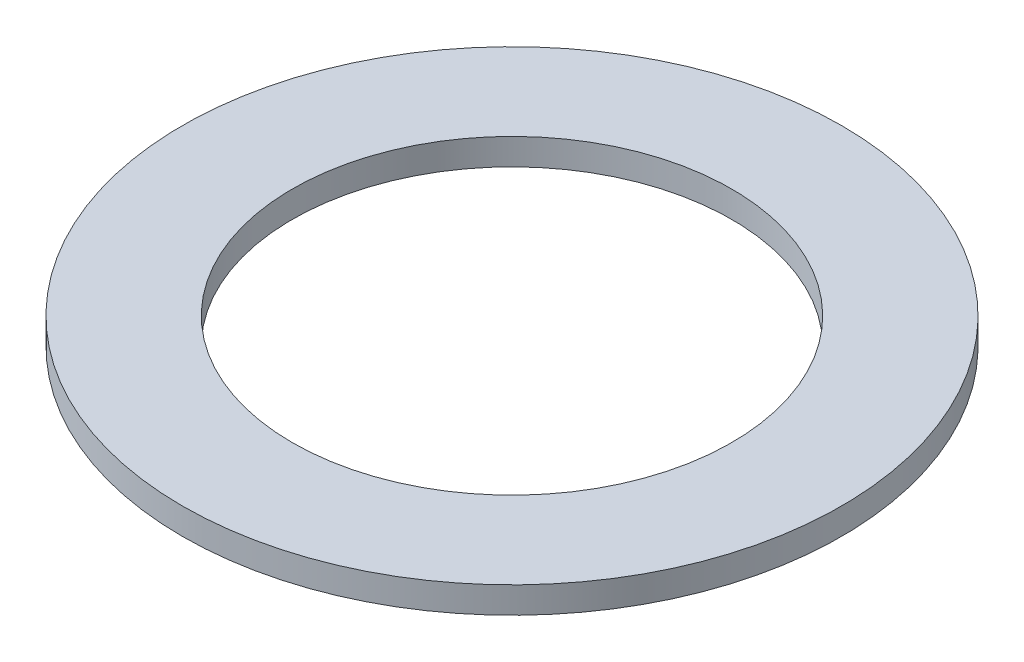
ISO-10303-21;
HEADER;
FILE_DESCRIPTION(('STEP AP214'),'2;1');
FILE_NAME('part.step','',(''),(''),'','','');
FILE_SCHEMA(('AUTOMOTIVE_DESIGN { 1 0 10303 214 1 1 1 1 }'));
ENDSEC;
DATA;
#1=APPLICATION_CONTEXT('core data for automotive mechanical design processes');
#2=APPLICATION_PROTOCOL_DEFINITION('international standard','automotive_design',2000,#1);
#3=PRODUCT_CONTEXT('',#1,'mechanical');
#4=PRODUCT('Part','Part','',(#3));
#5=PRODUCT_RELATED_PRODUCT_CATEGORY('part','',(#4));
#6=PRODUCT_DEFINITION_FORMATION('','',#4);
#7=PRODUCT_DEFINITION_CONTEXT('part definition',#1,'design');
#8=PRODUCT_DEFINITION('design','',#6,#7);
#9=PRODUCT_DEFINITION_SHAPE('','',#8);
#10=(LENGTH_UNIT() NAMED_UNIT(*) SI_UNIT(.MILLI.,.METRE.));
#11=(NAMED_UNIT(*) PLANE_ANGLE_UNIT() SI_UNIT($,.RADIAN.));
#12=(NAMED_UNIT(*) SI_UNIT($,.STERADIAN.) SOLID_ANGLE_UNIT());
#13=UNCERTAINTY_MEASURE_WITH_UNIT(LENGTH_MEASURE(1.E-05),#10,'distance_accuracy_value','');
#14=(GEOMETRIC_REPRESENTATION_CONTEXT(3) GLOBAL_UNCERTAINTY_ASSIGNED_CONTEXT((#13)) GLOBAL_UNIT_ASSIGNED_CONTEXT((#10,
#11,#12)) REPRESENTATION_CONTEXT('',''));
#15=CARTESIAN_POINT('',(0.,0.,0.));
#16=DIRECTION('',(0.,0.,1.));
#17=DIRECTION('',(1.,0.,0.));
#18=AXIS2_PLACEMENT_3D('',#15,#16,#17);
#19=CARTESIAN_POINT('',(0.,0.762,0.));
#20=DIRECTION('',(0.,-1.,0.));
#21=DIRECTION('',(0.,0.,-1.));
#22=AXIS2_PLACEMENT_3D('',#19,#20,#21);
#23=CYLINDRICAL_SURFACE('',#22,9.525);
#24=CARTESIAN_POINT('',(0.,0.762,0.));
#25=DIRECTION('',(0.,1.,0.));
#26=DIRECTION('',(0.,0.,1.));
#27=AXIS2_PLACEMENT_3D('',#24,#25,#26);
#28=CIRCLE('',#27,9.525);
#29=CARTESIAN_POINT('',(0.,0.762,9.525));
#30=VERTEX_POINT('',#29);
#31=EDGE_CURVE('E10',#30,#30,#28,.T.);
#32=ORIENTED_EDGE('',*,*,#31,.F.);
#33=EDGE_LOOP('',(#32));
#34=FACE_BOUND('',#33,.T.);
#35=CARTESIAN_POINT('',(0.,0.,0.));
#36=DIRECTION('',(0.,1.,0.));
#37=DIRECTION('',(0.,0.,1.));
#38=AXIS2_PLACEMENT_3D('',#35,#36,#37);
#39=CIRCLE('',#38,9.525);
#40=CARTESIAN_POINT('',(0.,0.,9.525));
#41=VERTEX_POINT('',#40);
#42=EDGE_CURVE('E37',#41,#41,#39,.T.);
#43=ORIENTED_EDGE('',*,*,#42,.T.);
#44=EDGE_LOOP('',(#43));
#45=FACE_BOUND('',#44,.T.);
#46=ADVANCED_FACE('F34',(#34,#45),#23,.T.);
#47=CARTESIAN_POINT('',(0.,0.762,0.));
#48=DIRECTION('',(0.,1.,0.));
#49=DIRECTION('',(0.,0.,1.));
#50=AXIS2_PLACEMENT_3D('',#47,#48,#49);
#51=PLANE('',#50);
#52=CARTESIAN_POINT('',(0.,0.762,0.));
#53=DIRECTION('',(0.,1.,0.));
#54=DIRECTION('',(0.,0.,1.));
#55=AXIS2_PLACEMENT_3D('',#52,#53,#54);
#56=CIRCLE('',#55,6.35);
#57=CARTESIAN_POINT('',(0.,0.762,6.35));
#58=VERTEX_POINT('',#57);
#59=EDGE_CURVE('E46',#58,#58,#56,.T.);
#60=ORIENTED_EDGE('',*,*,#59,.F.);
#61=EDGE_LOOP('',(#60));
#62=FACE_BOUND('',#61,.T.);
#63=ORIENTED_EDGE('',*,*,#31,.T.);
#64=EDGE_LOOP('',(#63));
#65=FACE_BOUND('',#64,.T.);
#66=ADVANCED_FACE('F61',(#62,#65),#51,.T.);
#67=CARTESIAN_POINT('',(0.,0.,0.));
#68=DIRECTION('',(0.,1.,0.));
#69=DIRECTION('',(0.,0.,1.));
#70=AXIS2_PLACEMENT_3D('',#67,#68,#69);
#71=PLANE('',#70);
#72=CARTESIAN_POINT('',(0.,0.,0.));
#73=DIRECTION('',(0.,1.,0.));
#74=DIRECTION('',(0.,0.,1.));
#75=AXIS2_PLACEMENT_3D('',#72,#73,#74);
#76=CIRCLE('',#75,6.35);
#77=CARTESIAN_POINT('',(0.,0.,6.35));
#78=VERTEX_POINT('',#77);
#79=EDGE_CURVE('E44',#78,#78,#76,.T.);
#80=ORIENTED_EDGE('',*,*,#79,.T.);
#81=EDGE_LOOP('',(#80));
#82=FACE_BOUND('',#81,.T.);
#83=ORIENTED_EDGE('',*,*,#42,.F.);
#84=EDGE_LOOP('',(#83));
#85=FACE_BOUND('',#84,.T.);
#86=ADVANCED_FACE('F52',(#82,#85),#71,.F.);
#87=CARTESIAN_POINT('',(0.,0.,0.));
#88=DIRECTION('',(0.,1.,0.));
#89=DIRECTION('',(0.,0.,1.));
#90=AXIS2_PLACEMENT_3D('',#87,#88,#89);
#91=CYLINDRICAL_SURFACE('',#90,6.35);
#92=ORIENTED_EDGE('',*,*,#79,.F.);
#93=EDGE_LOOP('',(#92));
#94=FACE_BOUND('',#93,.T.);
#95=ORIENTED_EDGE('',*,*,#59,.T.);
#96=EDGE_LOOP('',(#95));
#97=FACE_BOUND('',#96,.T.);
#98=ADVANCED_FACE('F55',(#94,#97),#91,.F.);
#99=CLOSED_SHELL('',(#46,#66,#86,#98));
#100=MANIFOLD_SOLID_BREP('B2',#99);
#101=ADVANCED_BREP_SHAPE_REPRESENTATION('',(#18,#100),#14);
#102=SHAPE_DEFINITION_REPRESENTATION(#9,#101);
ENDSEC;
END-ISO-10303-21;
